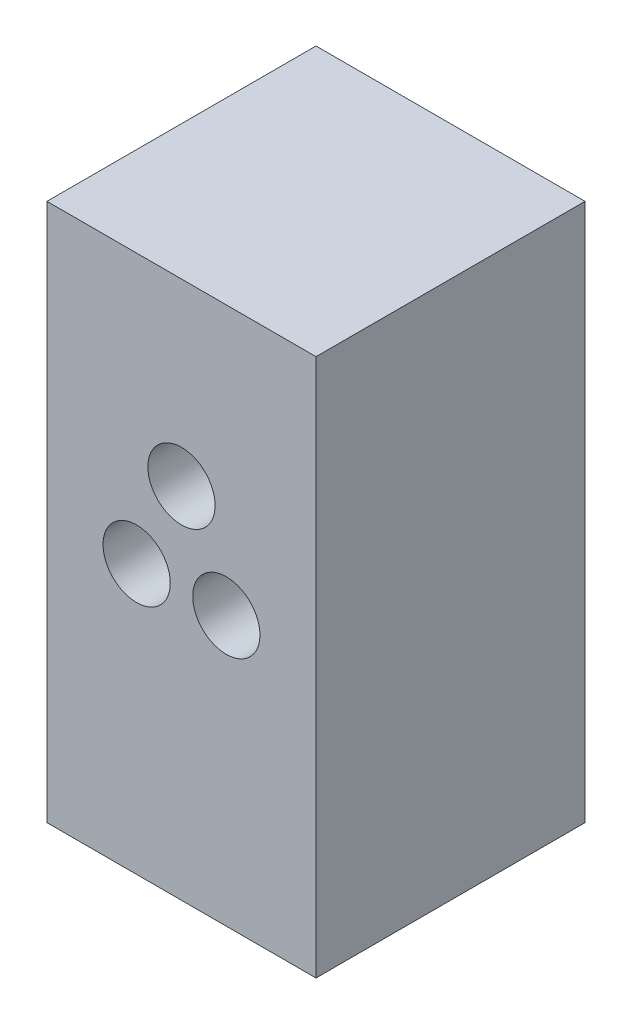
ISO-10303-21;
HEADER;
FILE_DESCRIPTION(('STEP AP214'),'2;1');
FILE_NAME('part.step','',(''),(''),'','','');
FILE_SCHEMA(('AUTOMOTIVE_DESIGN { 1 0 10303 214 1 1 1 1 }'));
ENDSEC;
DATA;
#1=APPLICATION_CONTEXT('core data for automotive mechanical design processes');
#2=APPLICATION_PROTOCOL_DEFINITION('international standard','automotive_design',2000,#1);
#3=PRODUCT_CONTEXT('',#1,'mechanical');
#4=PRODUCT('Part','Part','',(#3));
#5=PRODUCT_RELATED_PRODUCT_CATEGORY('part','',(#4));
#6=PRODUCT_DEFINITION_FORMATION('','',#4);
#7=PRODUCT_DEFINITION_CONTEXT('part definition',#1,'design');
#8=PRODUCT_DEFINITION('design','',#6,#7);
#9=PRODUCT_DEFINITION_SHAPE('','',#8);
#10=(LENGTH_UNIT() NAMED_UNIT(*) SI_UNIT(.MILLI.,.METRE.));
#11=(NAMED_UNIT(*) PLANE_ANGLE_UNIT() SI_UNIT($,.RADIAN.));
#12=(NAMED_UNIT(*) SI_UNIT($,.STERADIAN.) SOLID_ANGLE_UNIT());
#13=UNCERTAINTY_MEASURE_WITH_UNIT(LENGTH_MEASURE(1.E-05),#10,'distance_accuracy_value','');
#14=(GEOMETRIC_REPRESENTATION_CONTEXT(3) GLOBAL_UNCERTAINTY_ASSIGNED_CONTEXT((#13)) GLOBAL_UNIT_ASSIGNED_CONTEXT((#10,
#11,#12)) REPRESENTATION_CONTEXT('',''));
#15=CARTESIAN_POINT('',(0.,0.,0.));
#16=DIRECTION('',(0.,0.,1.));
#17=DIRECTION('',(1.,0.,0.));
#18=AXIS2_PLACEMENT_3D('',#15,#16,#17);
#19=CARTESIAN_POINT('',(0.,-6.35,6.35));
#20=DIRECTION('',(0.,1.,0.));
#21=DIRECTION('',(0.,0.,1.));
#22=AXIS2_PLACEMENT_3D('',#19,#20,#21);
#23=PLANE('',#22);
#24=DIRECTION('',(1.,0.,0.));
#25=VECTOR('',#24,1.);
#26=CARTESIAN_POINT('',(0.,-6.35,0.));
#27=LINE('',#26,#25);
#28=CARTESIAN_POINT('',(-3.175,-6.35,0.));
#29=VERTEX_POINT('',#28);
#30=CARTESIAN_POINT('',(3.175,-6.35,0.));
#31=VERTEX_POINT('',#30);
#32=EDGE_CURVE('E113',#29,#31,#27,.T.);
#33=ORIENTED_EDGE('',*,*,#32,.T.);
#34=DIRECTION('',(0.,0.,-1.));
#35=VECTOR('',#34,1.);
#36=CARTESIAN_POINT('',(3.175,-6.35,6.35));
#37=LINE('',#36,#35);
#38=CARTESIAN_POINT('',(3.175,-6.35,6.35));
#39=VERTEX_POINT('',#38);
#40=EDGE_CURVE('E11',#39,#31,#37,.T.);
#41=ORIENTED_EDGE('',*,*,#40,.F.);
#42=DIRECTION('',(1.,0.,0.));
#43=VECTOR('',#42,1.);
#44=CARTESIAN_POINT('',(0.,-6.35,6.35));
#45=LINE('',#44,#43);
#46=CARTESIAN_POINT('',(-3.175,-6.35,6.35));
#47=VERTEX_POINT('',#46);
#48=EDGE_CURVE('E95',#47,#39,#45,.T.);
#49=ORIENTED_EDGE('',*,*,#48,.F.);
#50=DIRECTION('',(0.,0.,-1.));
#51=VECTOR('',#50,1.);
#52=CARTESIAN_POINT('',(-3.175,-6.35,6.35));
#53=LINE('',#52,#51);
#54=EDGE_CURVE('E62',#47,#29,#53,.T.);
#55=ORIENTED_EDGE('',*,*,#54,.T.);
#56=EDGE_LOOP('',(#33,#41,#49,#55));
#57=FACE_BOUND('',#56,.T.);
#58=ADVANCED_FACE('F45',(#57),#23,.F.);
#59=CARTESIAN_POINT('',(3.175,0.,6.35));
#60=DIRECTION('',(-1.,0.,0.));
#61=DIRECTION('',(0.,0.,1.));
#62=AXIS2_PLACEMENT_3D('',#59,#60,#61);
#63=PLANE('',#62);
#64=DIRECTION('',(0.,1.,0.));
#65=VECTOR('',#64,1.);
#66=CARTESIAN_POINT('',(3.175,0.,0.));
#67=LINE('',#66,#65);
#68=CARTESIAN_POINT('',(3.175,6.35,0.));
#69=VERTEX_POINT('',#68);
#70=EDGE_CURVE('E101',#31,#69,#67,.T.);
#71=ORIENTED_EDGE('',*,*,#70,.T.);
#72=DIRECTION('',(0.,0.,-1.));
#73=VECTOR('',#72,1.);
#74=CARTESIAN_POINT('',(3.175,6.35,6.35));
#75=LINE('',#74,#73);
#76=CARTESIAN_POINT('',(3.175,6.35,6.35));
#77=VERTEX_POINT('',#76);
#78=EDGE_CURVE('E54',#77,#69,#75,.T.);
#79=ORIENTED_EDGE('',*,*,#78,.F.);
#80=DIRECTION('',(0.,1.,0.));
#81=VECTOR('',#80,1.);
#82=CARTESIAN_POINT('',(3.175,0.,6.35));
#83=LINE('',#82,#81);
#84=EDGE_CURVE('E87',#39,#77,#83,.T.);
#85=ORIENTED_EDGE('',*,*,#84,.F.);
#86=ORIENTED_EDGE('',*,*,#40,.T.);
#87=EDGE_LOOP('',(#71,#79,#85,#86));
#88=FACE_BOUND('',#87,.T.);
#89=ADVANCED_FACE('F100',(#88),#63,.F.);
#90=CARTESIAN_POINT('',(0.,6.35,6.35));
#91=DIRECTION('',(0.,1.,0.));
#92=DIRECTION('',(0.,0.,1.));
#93=AXIS2_PLACEMENT_3D('',#90,#91,#92);
#94=PLANE('',#93);
#95=DIRECTION('',(1.,0.,0.));
#96=VECTOR('',#95,1.);
#97=CARTESIAN_POINT('',(0.,6.35,0.));
#98=LINE('',#97,#96);
#99=CARTESIAN_POINT('',(-3.175,6.35,0.));
#100=VERTEX_POINT('',#99);
#101=EDGE_CURVE('E119',#100,#69,#98,.T.);
#102=ORIENTED_EDGE('',*,*,#101,.F.);
#103=DIRECTION('',(0.,0.,-1.));
#104=VECTOR('',#103,1.);
#105=CARTESIAN_POINT('',(-3.175,6.35,6.35));
#106=LINE('',#105,#104);
#107=CARTESIAN_POINT('',(-3.175,6.35,6.35));
#108=VERTEX_POINT('',#107);
#109=EDGE_CURVE('E76',#108,#100,#106,.T.);
#110=ORIENTED_EDGE('',*,*,#109,.F.);
#111=DIRECTION('',(1.,0.,0.));
#112=VECTOR('',#111,1.);
#113=CARTESIAN_POINT('',(0.,6.35,6.35));
#114=LINE('',#113,#112);
#115=EDGE_CURVE('E94',#108,#77,#114,.T.);
#116=ORIENTED_EDGE('',*,*,#115,.T.);
#117=ORIENTED_EDGE('',*,*,#78,.T.);
#118=EDGE_LOOP('',(#102,#110,#116,#117));
#119=FACE_BOUND('',#118,.T.);
#120=ADVANCED_FACE('F105',(#119),#94,.T.);
#121=CARTESIAN_POINT('',(-3.175,0.,6.35));
#122=DIRECTION('',(-1.,0.,0.));
#123=DIRECTION('',(0.,0.,1.));
#124=AXIS2_PLACEMENT_3D('',#121,#122,#123);
#125=PLANE('',#124);
#126=DIRECTION('',(0.,1.,0.));
#127=VECTOR('',#126,1.);
#128=CARTESIAN_POINT('',(-3.175,0.,0.));
#129=LINE('',#128,#127);
#130=EDGE_CURVE('E122',#29,#100,#129,.T.);
#131=ORIENTED_EDGE('',*,*,#130,.F.);
#132=ORIENTED_EDGE('',*,*,#54,.F.);
#133=DIRECTION('',(0.,1.,0.));
#134=VECTOR('',#133,1.);
#135=CARTESIAN_POINT('',(-3.175,0.,6.35));
#136=LINE('',#135,#134);
#137=EDGE_CURVE('E107',#47,#108,#136,.T.);
#138=ORIENTED_EDGE('',*,*,#137,.T.);
#139=ORIENTED_EDGE('',*,*,#109,.T.);
#140=EDGE_LOOP('',(#131,#132,#138,#139));
#141=FACE_BOUND('',#140,.T.);
#142=ADVANCED_FACE('F168',(#141),#125,.T.);
#143=CARTESIAN_POINT('',(0.,0.,6.35));
#144=DIRECTION('',(0.,0.,1.));
#145=DIRECTION('',(1.,0.,0.));
#146=AXIS2_PLACEMENT_3D('',#143,#144,#145);
#147=PLANE('',#146);
#148=CARTESIAN_POINT('',(1.05833333333333,0.,6.35));
#149=DIRECTION('',(0.,0.,1.));
#150=DIRECTION('',(1.,0.,0.));
#151=AXIS2_PLACEMENT_3D('',#148,#149,#150);
#152=CIRCLE('',#151,0.79375);
#153=CARTESIAN_POINT('',(1.85208333333333,0.,6.35));
#154=VERTEX_POINT('',#153);
#155=EDGE_CURVE('E140',#154,#154,#152,.T.);
#156=ORIENTED_EDGE('',*,*,#155,.F.);
#157=EDGE_LOOP('',(#156));
#158=FACE_BOUND('',#157,.T.);
#159=CARTESIAN_POINT('',(0.,2.11666666666667,6.35));
#160=DIRECTION('',(0.,0.,1.));
#161=DIRECTION('',(1.,0.,0.));
#162=AXIS2_PLACEMENT_3D('',#159,#160,#161);
#163=CIRCLE('',#162,0.79375);
#164=CARTESIAN_POINT('',(0.79375,2.11666666666667,6.35));
#165=VERTEX_POINT('',#164);
#166=EDGE_CURVE('E148',#165,#165,#163,.T.);
#167=ORIENTED_EDGE('',*,*,#166,.F.);
#168=EDGE_LOOP('',(#167));
#169=FACE_BOUND('',#168,.T.);
#170=CARTESIAN_POINT('',(-1.05833333333333,0.,6.35));
#171=DIRECTION('',(0.,0.,1.));
#172=DIRECTION('',(1.,0.,0.));
#173=AXIS2_PLACEMENT_3D('',#170,#171,#172);
#174=CIRCLE('',#173,0.79375);
#175=CARTESIAN_POINT('',(-0.264583333333335,0.,6.35));
#176=VERTEX_POINT('',#175);
#177=EDGE_CURVE('E132',#176,#176,#174,.T.);
#178=ORIENTED_EDGE('',*,*,#177,.F.);
#179=EDGE_LOOP('',(#178));
#180=FACE_BOUND('',#179,.T.);
#181=ORIENTED_EDGE('',*,*,#48,.T.);
#182=ORIENTED_EDGE('',*,*,#84,.T.);
#183=ORIENTED_EDGE('',*,*,#115,.F.);
#184=ORIENTED_EDGE('',*,*,#137,.F.);
#185=EDGE_LOOP('',(#181,#182,#183,#184));
#186=FACE_BOUND('',#185,.T.);
#187=ADVANCED_FACE('F91',(#158,#169,#180,#186),#147,.T.);
#188=CARTESIAN_POINT('',(0.,0.,0.));
#189=DIRECTION('',(0.,0.,1.));
#190=DIRECTION('',(1.,0.,0.));
#191=AXIS2_PLACEMENT_3D('',#188,#189,#190);
#192=PLANE('',#191);
#193=ORIENTED_EDGE('',*,*,#32,.F.);
#194=ORIENTED_EDGE('',*,*,#130,.T.);
#195=ORIENTED_EDGE('',*,*,#101,.T.);
#196=ORIENTED_EDGE('',*,*,#70,.F.);
#197=EDGE_LOOP('',(#193,#194,#195,#196));
#198=FACE_BOUND('',#197,.T.);
#199=ADVANCED_FACE('F167',(#198),#192,.F.);
#200=CARTESIAN_POINT('',(-1.05833333333333,0.,5.08));
#201=DIRECTION('',(0.,0.,1.));
#202=DIRECTION('',(1.,0.,0.));
#203=AXIS2_PLACEMENT_3D('',#200,#201,#202);
#204=CYLINDRICAL_SURFACE('',#203,0.79375);
#205=CARTESIAN_POINT('',(-1.05833333333333,0.,5.08));
#206=DIRECTION('',(0.,0.,1.));
#207=DIRECTION('',(1.,0.,0.));
#208=AXIS2_PLACEMENT_3D('',#205,#206,#207);
#209=CIRCLE('',#208,0.79375);
#210=CARTESIAN_POINT('',(-0.264583333333335,0.,5.08));
#211=VERTEX_POINT('',#210);
#212=EDGE_CURVE('E116',#211,#211,#209,.T.);
#213=ORIENTED_EDGE('',*,*,#212,.F.);
#214=EDGE_LOOP('',(#213));
#215=FACE_BOUND('',#214,.T.);
#216=ORIENTED_EDGE('',*,*,#177,.T.);
#217=EDGE_LOOP('',(#216));
#218=FACE_BOUND('',#217,.T.);
#219=ADVANCED_FACE('F173',(#215,#218),#204,.F.);
#220=CARTESIAN_POINT('',(-1.05833333333333,0.,5.08));
#221=DIRECTION('',(0.,0.,1.));
#222=DIRECTION('',(1.,0.,0.));
#223=AXIS2_PLACEMENT_3D('',#220,#221,#222);
#224=PLANE('',#223);
#225=ORIENTED_EDGE('',*,*,#212,.T.);
#226=EDGE_LOOP('',(#225));
#227=FACE_BOUND('',#226,.T.);
#228=ADVANCED_FACE('F161',(#227),#224,.T.);
#229=CARTESIAN_POINT('',(0.,2.11666666666667,5.08));
#230=DIRECTION('',(0.,0.,1.));
#231=DIRECTION('',(1.,0.,0.));
#232=AXIS2_PLACEMENT_3D('',#229,#230,#231);
#233=CYLINDRICAL_SURFACE('',#232,0.79375);
#234=CARTESIAN_POINT('',(0.,2.11666666666667,5.08));
#235=DIRECTION('',(0.,0.,1.));
#236=DIRECTION('',(1.,0.,0.));
#237=AXIS2_PLACEMENT_3D('',#234,#235,#236);
#238=CIRCLE('',#237,0.79375);
#239=CARTESIAN_POINT('',(0.79375,2.11666666666667,5.08));
#240=VERTEX_POINT('',#239);
#241=EDGE_CURVE('E136',#240,#240,#238,.T.);
#242=ORIENTED_EDGE('',*,*,#241,.F.);
#243=EDGE_LOOP('',(#242));
#244=FACE_BOUND('',#243,.T.);
#245=ORIENTED_EDGE('',*,*,#166,.T.);
#246=EDGE_LOOP('',(#245));
#247=FACE_BOUND('',#246,.T.);
#248=ADVANCED_FACE('F158',(#244,#247),#233,.F.);
#249=CARTESIAN_POINT('',(0.,2.11666666666667,5.08));
#250=DIRECTION('',(0.,0.,1.));
#251=DIRECTION('',(1.,0.,0.));
#252=AXIS2_PLACEMENT_3D('',#249,#250,#251);
#253=PLANE('',#252);
#254=ORIENTED_EDGE('',*,*,#241,.T.);
#255=EDGE_LOOP('',(#254));
#256=FACE_BOUND('',#255,.T.);
#257=ADVANCED_FACE('F156',(#256),#253,.T.);
#258=CARTESIAN_POINT('',(1.05833333333333,0.,5.08));
#259=DIRECTION('',(0.,0.,1.));
#260=DIRECTION('',(1.,0.,0.));
#261=AXIS2_PLACEMENT_3D('',#258,#259,#260);
#262=CYLINDRICAL_SURFACE('',#261,0.79375);
#263=CARTESIAN_POINT('',(1.05833333333333,0.,5.08));
#264=DIRECTION('',(0.,0.,1.));
#265=DIRECTION('',(1.,0.,0.));
#266=AXIS2_PLACEMENT_3D('',#263,#264,#265);
#267=CIRCLE('',#266,0.79375);
#268=CARTESIAN_POINT('',(1.85208333333333,0.,5.08));
#269=VERTEX_POINT('',#268);
#270=EDGE_CURVE('E144',#269,#269,#267,.T.);
#271=ORIENTED_EDGE('',*,*,#270,.F.);
#272=EDGE_LOOP('',(#271));
#273=FACE_BOUND('',#272,.T.);
#274=ORIENTED_EDGE('',*,*,#155,.T.);
#275=EDGE_LOOP('',(#274));
#276=FACE_BOUND('',#275,.T.);
#277=ADVANCED_FACE('F256',(#273,#276),#262,.F.);
#278=CARTESIAN_POINT('',(1.05833333333333,0.,5.08));
#279=DIRECTION('',(0.,0.,1.));
#280=DIRECTION('',(1.,0.,0.));
#281=AXIS2_PLACEMENT_3D('',#278,#279,#280);
#282=PLANE('',#281);
#283=ORIENTED_EDGE('',*,*,#270,.T.);
#284=EDGE_LOOP('',(#283));
#285=FACE_BOUND('',#284,.T.);
#286=ADVANCED_FACE('F265',(#285),#282,.T.);
#287=CLOSED_SHELL('',(#58,#89,#120,#142,#187,#199,#219,#228,#248,#257,#277,#286));
#288=MANIFOLD_SOLID_BREP('B2',#287);
#289=ADVANCED_BREP_SHAPE_REPRESENTATION('',(#18,#288),#14);
#290=SHAPE_DEFINITION_REPRESENTATION(#9,#289);
ENDSEC;
END-ISO-10303-21;
